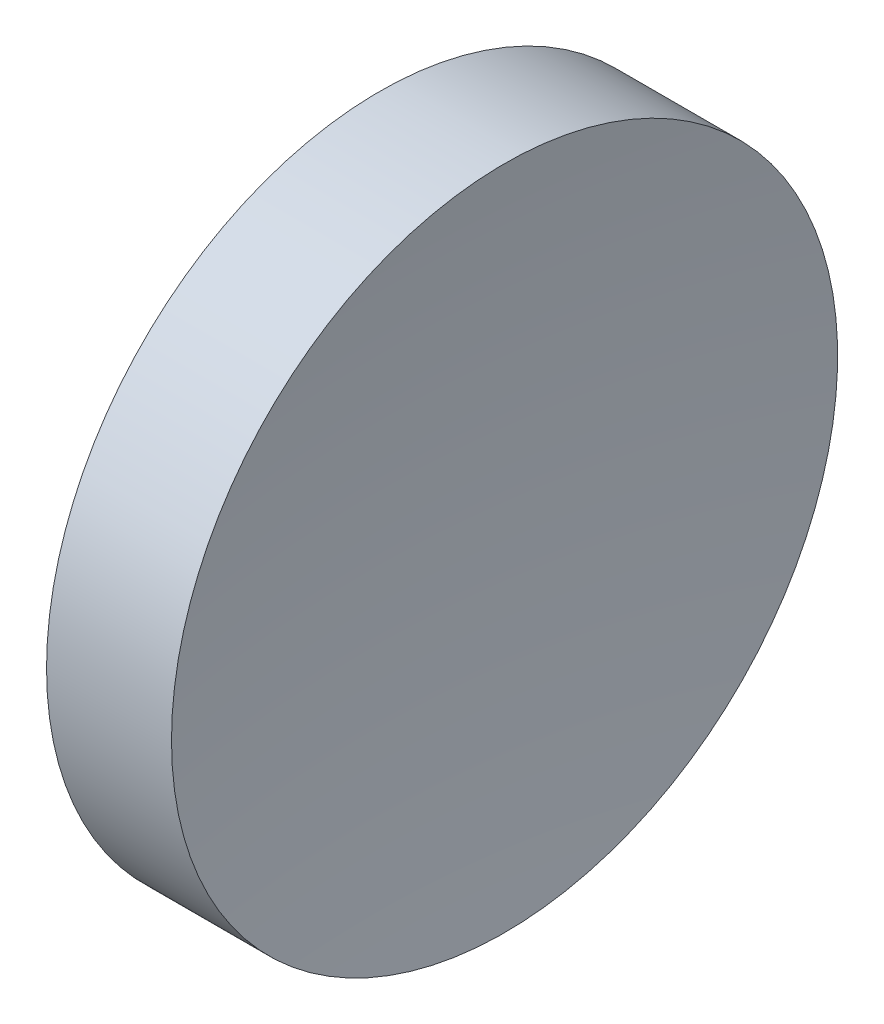
ISO-10303-21;
HEADER;
FILE_DESCRIPTION(('STEP AP214'),'2;1');
FILE_NAME('part.step','',(''),(''),'','','');
FILE_SCHEMA(('AUTOMOTIVE_DESIGN { 1 0 10303 214 1 1 1 1 }'));
ENDSEC;
DATA;
#1=APPLICATION_CONTEXT('core data for automotive mechanical design processes');
#2=APPLICATION_PROTOCOL_DEFINITION('international standard','automotive_design',2000,#1);
#3=PRODUCT_CONTEXT('',#1,'mechanical');
#4=PRODUCT('Part','Part','',(#3));
#5=PRODUCT_RELATED_PRODUCT_CATEGORY('part','',(#4));
#6=PRODUCT_DEFINITION_FORMATION('','',#4);
#7=PRODUCT_DEFINITION_CONTEXT('part definition',#1,'design');
#8=PRODUCT_DEFINITION('design','',#6,#7);
#9=PRODUCT_DEFINITION_SHAPE('','',#8);
#10=(LENGTH_UNIT() NAMED_UNIT(*) SI_UNIT(.MILLI.,.METRE.));
#11=(NAMED_UNIT(*) PLANE_ANGLE_UNIT() SI_UNIT($,.RADIAN.));
#12=(NAMED_UNIT(*) SI_UNIT($,.STERADIAN.) SOLID_ANGLE_UNIT());
#13=UNCERTAINTY_MEASURE_WITH_UNIT(LENGTH_MEASURE(1.E-05),#10,'distance_accuracy_value','');
#14=(GEOMETRIC_REPRESENTATION_CONTEXT(3) GLOBAL_UNCERTAINTY_ASSIGNED_CONTEXT((#13)) GLOBAL_UNIT_ASSIGNED_CONTEXT((#10,
#11,#12)) REPRESENTATION_CONTEXT('',''));
#15=CARTESIAN_POINT('',(0.,0.,0.));
#16=DIRECTION('',(0.,0.,1.));
#17=DIRECTION('',(1.,0.,0.));
#18=AXIS2_PLACEMENT_3D('',#15,#16,#17);
#19=CARTESIAN_POINT('',(0.,0.,0.));
#20=DIRECTION('',(1.,0.,0.));
#21=DIRECTION('',(0.,0.,-1.));
#22=AXIS2_PLACEMENT_3D('',#19,#20,#21);
#23=PLANE('',#22);
#24=CARTESIAN_POINT('',(0.,0.,0.));
#25=DIRECTION('',(-1.,0.,0.));
#26=DIRECTION('',(0.,0.,1.));
#27=AXIS2_PLACEMENT_3D('',#24,#25,#26);
#28=CIRCLE('',#27,25.4);
#29=CARTESIAN_POINT('',(0.,0.,25.4));
#30=VERTEX_POINT('',#29);
#31=EDGE_CURVE('E41',#30,#30,#28,.T.);
#32=ORIENTED_EDGE('',*,*,#31,.T.);
#33=EDGE_LOOP('',(#32));
#34=FACE_BOUND('',#33,.T.);
#35=ADVANCED_FACE('F35',(#34),#23,.F.);
#36=CARTESIAN_POINT('',(207.91,0.,0.));
#37=DIRECTION('',(-1.,0.,0.));
#38=DIRECTION('',(0.,0.,1.));
#39=AXIS2_PLACEMENT_3D('',#36,#37,#38);
#40=SPHERICAL_SURFACE('',#39,200.);
#41=CARTESIAN_POINT('',(9.52945659919166,0.,0.));
#42=DIRECTION('',(-1.,0.,0.));
#43=DIRECTION('',(0.,0.,1.));
#44=AXIS2_PLACEMENT_3D('',#41,#42,#43);
#45=CIRCLE('',#44,25.4);
#46=CARTESIAN_POINT('',(9.52945659919166,0.,25.4));
#47=VERTEX_POINT('',#46);
#48=EDGE_CURVE('E10',#47,#47,#45,.T.);
#49=ORIENTED_EDGE('',*,*,#48,.F.);
#50=EDGE_LOOP('',(#49));
#51=FACE_BOUND('',#50,.T.);
#52=ADVANCED_FACE('F50',(#51),#40,.F.);
#53=CARTESIAN_POINT('',(0.,0.,0.));
#54=DIRECTION('',(-1.,0.,0.));
#55=DIRECTION('',(0.,0.,1.));
#56=AXIS2_PLACEMENT_3D('',#53,#54,#55);
#57=CYLINDRICAL_SURFACE('',#56,25.4);
#58=ORIENTED_EDGE('',*,*,#31,.F.);
#59=EDGE_LOOP('',(#58));
#60=FACE_BOUND('',#59,.T.);
#61=ORIENTED_EDGE('',*,*,#48,.T.);
#62=EDGE_LOOP('',(#61));
#63=FACE_BOUND('',#62,.T.);
#64=ADVANCED_FACE('F48',(#60,#63),#57,.T.);
#65=CLOSED_SHELL('',(#35,#52,#64));
#66=MANIFOLD_SOLID_BREP('B2',#65);
#67=ADVANCED_BREP_SHAPE_REPRESENTATION('',(#18,#66),#14);
#68=SHAPE_DEFINITION_REPRESENTATION(#9,#67);
ENDSEC;
END-ISO-10303-21;
